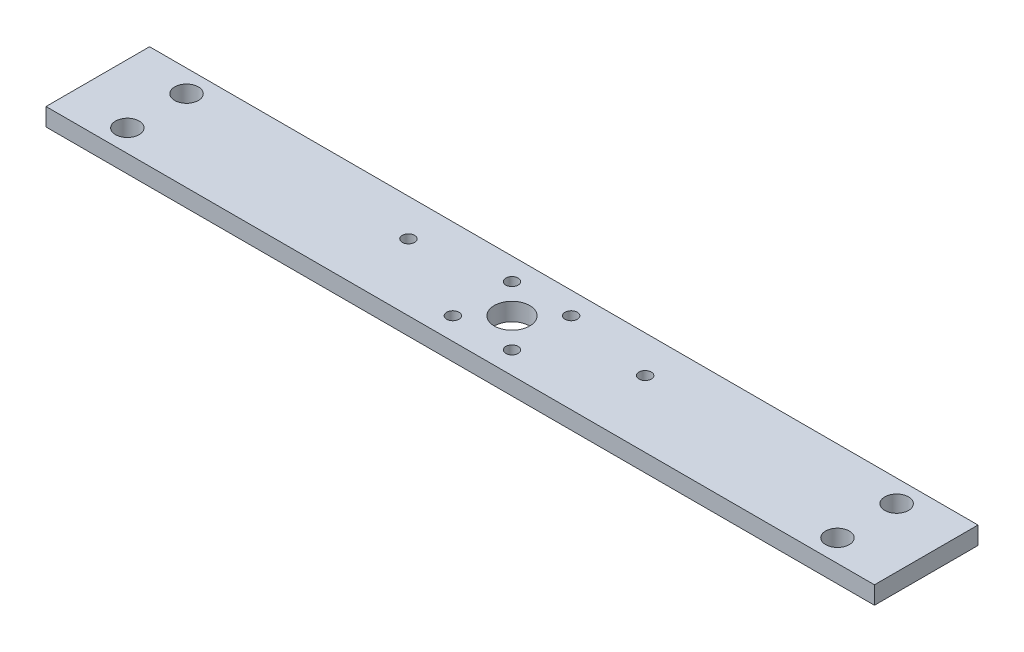
ISO-10303-21;
HEADER;
FILE_DESCRIPTION(('STEP AP214'),'2;1');
FILE_NAME('part.step','',(''),(''),'','','');
FILE_SCHEMA(('AUTOMOTIVE_DESIGN { 1 0 10303 214 1 1 1 1 }'));
ENDSEC;
DATA;
#1=APPLICATION_CONTEXT('core data for automotive mechanical design processes');
#2=APPLICATION_PROTOCOL_DEFINITION('international standard','automotive_design',2000,#1);
#3=PRODUCT_CONTEXT('',#1,'mechanical');
#4=PRODUCT('Part','Part','',(#3));
#5=PRODUCT_RELATED_PRODUCT_CATEGORY('part','',(#4));
#6=PRODUCT_DEFINITION_FORMATION('','',#4);
#7=PRODUCT_DEFINITION_CONTEXT('part definition',#1,'design');
#8=PRODUCT_DEFINITION('design','',#6,#7);
#9=PRODUCT_DEFINITION_SHAPE('','',#8);
#10=(LENGTH_UNIT() NAMED_UNIT(*) SI_UNIT(.MILLI.,.METRE.));
#11=(NAMED_UNIT(*) PLANE_ANGLE_UNIT() SI_UNIT($,.RADIAN.));
#12=(NAMED_UNIT(*) SI_UNIT($,.STERADIAN.) SOLID_ANGLE_UNIT());
#13=UNCERTAINTY_MEASURE_WITH_UNIT(LENGTH_MEASURE(1.E-05),#10,'distance_accuracy_value','');
#14=(GEOMETRIC_REPRESENTATION_CONTEXT(3) GLOBAL_UNCERTAINTY_ASSIGNED_CONTEXT((#13)) GLOBAL_UNIT_ASSIGNED_CONTEXT((#10,
#11,#12)) REPRESENTATION_CONTEXT('',''));
#15=CARTESIAN_POINT('',(0.,0.,0.));
#16=DIRECTION('',(0.,0.,1.));
#17=DIRECTION('',(1.,0.,0.));
#18=AXIS2_PLACEMENT_3D('',#15,#16,#17);
#19=CARTESIAN_POINT('',(0.,6.,0.));
#20=DIRECTION('',(0.,1.,0.));
#21=DIRECTION('',(0.,0.,1.));
#22=AXIS2_PLACEMENT_3D('',#19,#20,#21);
#23=PLANE('',#22);
#24=CARTESIAN_POINT('',(120.,6.,10.));
#25=DIRECTION('',(0.,1.,0.));
#26=DIRECTION('',(0.,0.,-1.));
#27=AXIS2_PLACEMENT_3D('',#24,#25,#26);
#28=CIRCLE('',#27,3.99999999999999);
#29=CARTESIAN_POINT('',(120.,6.,6.00000000000001));
#30=VERTEX_POINT('',#29);
#31=EDGE_CURVE('E198',#30,#30,#28,.T.);
#32=ORIENTED_EDGE('',*,*,#31,.F.);
#33=EDGE_LOOP('',(#32));
#34=FACE_BOUND('',#33,.T.);
#35=CARTESIAN_POINT('',(10.0000000000002,6.,10.));
#36=DIRECTION('',(0.,1.,0.));
#37=DIRECTION('',(0.,0.,1.));
#38=AXIS2_PLACEMENT_3D('',#35,#36,#37);
#39=CIRCLE('',#38,2.08);
#40=CARTESIAN_POINT('',(10.0000000000002,6.,12.08));
#41=VERTEX_POINT('',#40);
#42=EDGE_CURVE('E182',#41,#41,#39,.T.);
#43=ORIENTED_EDGE('',*,*,#42,.F.);
#44=EDGE_LOOP('',(#43));
#45=FACE_BOUND('',#44,.T.);
#46=CARTESIAN_POINT('',(-10.,6.,-9.99999999999986));
#47=DIRECTION('',(0.,1.,0.));
#48=DIRECTION('',(0.,0.,1.));
#49=AXIS2_PLACEMENT_3D('',#46,#47,#48);
#50=CIRCLE('',#49,2.08);
#51=CARTESIAN_POINT('',(-10.,6.,-7.91999999999986));
#52=VERTEX_POINT('',#51);
#53=EDGE_CURVE('E166',#52,#52,#50,.T.);
#54=ORIENTED_EDGE('',*,*,#53,.F.);
#55=EDGE_LOOP('',(#54));
#56=FACE_BOUND('',#55,.T.);
#57=CARTESIAN_POINT('',(-40.,6.,-5.00000000000001));
#58=DIRECTION('',(0.,1.,0.));
#59=DIRECTION('',(0.,0.,-1.));
#60=AXIS2_PLACEMENT_3D('',#57,#58,#59);
#61=CIRCLE('',#60,2.08);
#62=CARTESIAN_POINT('',(-40.,6.,-7.08));
#63=VERTEX_POINT('',#62);
#64=EDGE_CURVE('E150',#63,#63,#61,.T.);
#65=ORIENTED_EDGE('',*,*,#64,.F.);
#66=EDGE_LOOP('',(#65));
#67=FACE_BOUND('',#66,.T.);
#68=CARTESIAN_POINT('',(10.,6.,-10.));
#69=DIRECTION('',(0.,1.,0.));
#70=DIRECTION('',(0.,0.,1.));
#71=AXIS2_PLACEMENT_3D('',#68,#69,#70);
#72=CIRCLE('',#71,2.08);
#73=CARTESIAN_POINT('',(10.,6.,-7.92));
#74=VERTEX_POINT('',#73);
#75=EDGE_CURVE('E134',#74,#74,#72,.T.);
#76=ORIENTED_EDGE('',*,*,#75,.F.);
#77=EDGE_LOOP('',(#76));
#78=FACE_BOUND('',#77,.T.);
#79=DIRECTION('',(0.,0.,-1.));
#80=VECTOR('',#79,1.);
#81=CARTESIAN_POINT('',(140.,6.,-17.5));
#82=LINE('',#81,#80);
#83=CARTESIAN_POINT('',(140.,6.,17.5));
#84=VERTEX_POINT('',#83);
#85=CARTESIAN_POINT('',(140.,6.,-17.5));
#86=VERTEX_POINT('',#85);
#87=EDGE_CURVE('E92',#84,#86,#82,.T.);
#88=ORIENTED_EDGE('',*,*,#87,.T.);
#89=DIRECTION('',(-1.,0.,0.));
#90=VECTOR('',#89,1.);
#91=CARTESIAN_POINT('',(-140.,6.,-17.5));
#92=LINE('',#91,#90);
#93=CARTESIAN_POINT('',(-140.,6.,-17.5));
#94=VERTEX_POINT('',#93);
#95=EDGE_CURVE('E87',#86,#94,#92,.T.);
#96=ORIENTED_EDGE('',*,*,#95,.T.);
#97=DIRECTION('',(0.,0.,1.));
#98=VECTOR('',#97,1.);
#99=CARTESIAN_POINT('',(-140.,6.,-17.5));
#100=LINE('',#99,#98);
#101=CARTESIAN_POINT('',(-140.,6.,17.5));
#102=VERTEX_POINT('',#101);
#103=EDGE_CURVE('E90',#94,#102,#100,.T.);
#104=ORIENTED_EDGE('',*,*,#103,.T.);
#105=DIRECTION('',(1.,0.,0.));
#106=VECTOR('',#105,1.);
#107=CARTESIAN_POINT('',(-140.,6.,17.5));
#108=LINE('',#107,#106);
#109=EDGE_CURVE('E57',#102,#84,#108,.T.);
#110=ORIENTED_EDGE('',*,*,#109,.T.);
#111=EDGE_LOOP('',(#88,#96,#104,#110));
#112=FACE_BOUND('',#111,.T.);
#113=CARTESIAN_POINT('',(40.,6.,-5.00000000000001));
#114=DIRECTION('',(0.,1.,0.));
#115=DIRECTION('',(0.,0.,1.));
#116=AXIS2_PLACEMENT_3D('',#113,#114,#115);
#117=CIRCLE('',#116,2.08);
#118=CARTESIAN_POINT('',(40.,6.,-2.92000000000001));
#119=VERTEX_POINT('',#118);
#120=EDGE_CURVE('E112',#119,#119,#117,.T.);
#121=ORIENTED_EDGE('',*,*,#120,.F.);
#122=EDGE_LOOP('',(#121));
#123=FACE_BOUND('',#122,.T.);
#124=CARTESIAN_POINT('',(120.,6.,-10.));
#125=DIRECTION('',(0.,1.,0.));
#126=DIRECTION('',(0.,0.,1.));
#127=AXIS2_PLACEMENT_3D('',#124,#125,#126);
#128=CIRCLE('',#127,3.99999999999999);
#129=CARTESIAN_POINT('',(120.,6.,-6.00000000000001));
#130=VERTEX_POINT('',#129);
#131=EDGE_CURVE('E142',#130,#130,#128,.T.);
#132=ORIENTED_EDGE('',*,*,#131,.F.);
#133=EDGE_LOOP('',(#132));
#134=FACE_BOUND('',#133,.T.);
#135=CARTESIAN_POINT('',(0.,6.,0.));
#136=DIRECTION('',(0.,1.,0.));
#137=DIRECTION('',(0.,0.,1.));
#138=AXIS2_PLACEMENT_3D('',#135,#136,#137);
#139=CIRCLE('',#138,6.);
#140=CARTESIAN_POINT('',(0.,6.,6.));
#141=VERTEX_POINT('',#140);
#142=EDGE_CURVE('E158',#141,#141,#139,.T.);
#143=ORIENTED_EDGE('',*,*,#142,.F.);
#144=EDGE_LOOP('',(#143));
#145=FACE_BOUND('',#144,.T.);
#146=CARTESIAN_POINT('',(-9.99999999999979,6.,10.0000000000001));
#147=DIRECTION('',(0.,1.,0.));
#148=DIRECTION('',(0.,0.,1.));
#149=AXIS2_PLACEMENT_3D('',#146,#147,#148);
#150=CIRCLE('',#149,2.08);
#151=CARTESIAN_POINT('',(-9.99999999999979,6.,12.0800000000001));
#152=VERTEX_POINT('',#151);
#153=EDGE_CURVE('E174',#152,#152,#150,.T.);
#154=ORIENTED_EDGE('',*,*,#153,.F.);
#155=EDGE_LOOP('',(#154));
#156=FACE_BOUND('',#155,.T.);
#157=CARTESIAN_POINT('',(-120.,6.,-10.));
#158=DIRECTION('',(0.,1.,0.));
#159=DIRECTION('',(0.,0.,-1.));
#160=AXIS2_PLACEMENT_3D('',#157,#158,#159);
#161=CIRCLE('',#160,3.99999999999999);
#162=CARTESIAN_POINT('',(-120.,6.,-14.));
#163=VERTEX_POINT('',#162);
#164=EDGE_CURVE('E190',#163,#163,#161,.T.);
#165=ORIENTED_EDGE('',*,*,#164,.F.);
#166=EDGE_LOOP('',(#165));
#167=FACE_BOUND('',#166,.T.);
#168=CARTESIAN_POINT('',(-120.,6.,10.));
#169=DIRECTION('',(0.,1.,0.));
#170=DIRECTION('',(0.,0.,1.));
#171=AXIS2_PLACEMENT_3D('',#168,#169,#170);
#172=CIRCLE('',#171,3.99999999999999);
#173=CARTESIAN_POINT('',(-120.,6.,14.));
#174=VERTEX_POINT('',#173);
#175=EDGE_CURVE('E206',#174,#174,#172,.T.);
#176=ORIENTED_EDGE('',*,*,#175,.F.);
#177=EDGE_LOOP('',(#176));
#178=FACE_BOUND('',#177,.T.);
#179=ADVANCED_FACE('F39',(#34,#45,#56,#67,#78,#112,#123,#134,#145,#156,#167,#178),#23,.T.);
#180=CARTESIAN_POINT('',(0.,0.,0.));
#181=DIRECTION('',(0.,1.,0.));
#182=DIRECTION('',(0.,0.,1.));
#183=AXIS2_PLACEMENT_3D('',#180,#181,#182);
#184=PLANE('',#183);
#185=DIRECTION('',(0.,0.,-1.));
#186=VECTOR('',#185,1.);
#187=CARTESIAN_POINT('',(140.,0.,-17.5));
#188=LINE('',#187,#186);
#189=CARTESIAN_POINT('',(140.,0.,17.5));
#190=VERTEX_POINT('',#189);
#191=CARTESIAN_POINT('',(140.,0.,-17.5));
#192=VERTEX_POINT('',#191);
#193=EDGE_CURVE('E108',#190,#192,#188,.T.);
#194=ORIENTED_EDGE('',*,*,#193,.F.);
#195=DIRECTION('',(1.,0.,0.));
#196=VECTOR('',#195,1.);
#197=CARTESIAN_POINT('',(-140.,0.,17.5));
#198=LINE('',#197,#196);
#199=CARTESIAN_POINT('',(-140.,0.,17.5));
#200=VERTEX_POINT('',#199);
#201=EDGE_CURVE('E80',#200,#190,#198,.T.);
#202=ORIENTED_EDGE('',*,*,#201,.F.);
#203=DIRECTION('',(0.,0.,1.));
#204=VECTOR('',#203,1.);
#205=CARTESIAN_POINT('',(-140.,0.,-17.5));
#206=LINE('',#205,#204);
#207=CARTESIAN_POINT('',(-140.,0.,-17.5));
#208=VERTEX_POINT('',#207);
#209=EDGE_CURVE('E74',#208,#200,#206,.T.);
#210=ORIENTED_EDGE('',*,*,#209,.F.);
#211=DIRECTION('',(-1.,0.,0.));
#212=VECTOR('',#211,1.);
#213=CARTESIAN_POINT('',(-140.,0.,-17.5));
#214=LINE('',#213,#212);
#215=EDGE_CURVE('E97',#192,#208,#214,.T.);
#216=ORIENTED_EDGE('',*,*,#215,.F.);
#217=EDGE_LOOP('',(#194,#202,#210,#216));
#218=FACE_BOUND('',#217,.T.);
#219=CARTESIAN_POINT('',(40.,0.,-5.00000000000001));
#220=DIRECTION('',(0.,1.,0.));
#221=DIRECTION('',(0.,0.,1.));
#222=AXIS2_PLACEMENT_3D('',#219,#220,#221);
#223=CIRCLE('',#222,2.08);
#224=CARTESIAN_POINT('',(40.,0.,-2.92000000000001));
#225=VERTEX_POINT('',#224);
#226=EDGE_CURVE('E130',#225,#225,#223,.T.);
#227=ORIENTED_EDGE('',*,*,#226,.T.);
#228=EDGE_LOOP('',(#227));
#229=FACE_BOUND('',#228,.T.);
#230=CARTESIAN_POINT('',(10.,0.,-10.));
#231=DIRECTION('',(0.,1.,0.));
#232=DIRECTION('',(0.,0.,1.));
#233=AXIS2_PLACEMENT_3D('',#230,#231,#232);
#234=CIRCLE('',#233,2.08);
#235=CARTESIAN_POINT('',(10.,0.,-7.92));
#236=VERTEX_POINT('',#235);
#237=EDGE_CURVE('E138',#236,#236,#234,.T.);
#238=ORIENTED_EDGE('',*,*,#237,.T.);
#239=EDGE_LOOP('',(#238));
#240=FACE_BOUND('',#239,.T.);
#241=CARTESIAN_POINT('',(120.,0.,-10.));
#242=DIRECTION('',(0.,1.,0.));
#243=DIRECTION('',(0.,0.,1.));
#244=AXIS2_PLACEMENT_3D('',#241,#242,#243);
#245=CIRCLE('',#244,3.99999999999999);
#246=CARTESIAN_POINT('',(120.,0.,-6.00000000000001));
#247=VERTEX_POINT('',#246);
#248=EDGE_CURVE('E146',#247,#247,#245,.T.);
#249=ORIENTED_EDGE('',*,*,#248,.T.);
#250=EDGE_LOOP('',(#249));
#251=FACE_BOUND('',#250,.T.);
#252=CARTESIAN_POINT('',(-40.,0.,-5.00000000000001));
#253=DIRECTION('',(0.,1.,0.));
#254=DIRECTION('',(0.,0.,-1.));
#255=AXIS2_PLACEMENT_3D('',#252,#253,#254);
#256=CIRCLE('',#255,2.08);
#257=CARTESIAN_POINT('',(-40.,0.,-7.08));
#258=VERTEX_POINT('',#257);
#259=EDGE_CURVE('E154',#258,#258,#256,.T.);
#260=ORIENTED_EDGE('',*,*,#259,.T.);
#261=EDGE_LOOP('',(#260));
#262=FACE_BOUND('',#261,.T.);
#263=CARTESIAN_POINT('',(0.,0.,0.));
#264=DIRECTION('',(0.,1.,0.));
#265=DIRECTION('',(0.,0.,1.));
#266=AXIS2_PLACEMENT_3D('',#263,#264,#265);
#267=CIRCLE('',#266,6.);
#268=CARTESIAN_POINT('',(0.,0.,6.));
#269=VERTEX_POINT('',#268);
#270=EDGE_CURVE('E162',#269,#269,#267,.T.);
#271=ORIENTED_EDGE('',*,*,#270,.T.);
#272=EDGE_LOOP('',(#271));
#273=FACE_BOUND('',#272,.T.);
#274=CARTESIAN_POINT('',(-10.,0.,-9.99999999999986));
#275=DIRECTION('',(0.,1.,0.));
#276=DIRECTION('',(0.,0.,1.));
#277=AXIS2_PLACEMENT_3D('',#274,#275,#276);
#278=CIRCLE('',#277,2.08);
#279=CARTESIAN_POINT('',(-10.,0.,-7.91999999999986));
#280=VERTEX_POINT('',#279);
#281=EDGE_CURVE('E170',#280,#280,#278,.T.);
#282=ORIENTED_EDGE('',*,*,#281,.T.);
#283=EDGE_LOOP('',(#282));
#284=FACE_BOUND('',#283,.T.);
#285=CARTESIAN_POINT('',(-9.99999999999979,0.,10.0000000000001));
#286=DIRECTION('',(0.,1.,0.));
#287=DIRECTION('',(0.,0.,1.));
#288=AXIS2_PLACEMENT_3D('',#285,#286,#287);
#289=CIRCLE('',#288,2.08);
#290=CARTESIAN_POINT('',(-9.99999999999979,0.,12.0800000000001));
#291=VERTEX_POINT('',#290);
#292=EDGE_CURVE('E178',#291,#291,#289,.T.);
#293=ORIENTED_EDGE('',*,*,#292,.T.);
#294=EDGE_LOOP('',(#293));
#295=FACE_BOUND('',#294,.T.);
#296=CARTESIAN_POINT('',(10.0000000000002,0.,10.));
#297=DIRECTION('',(0.,1.,0.));
#298=DIRECTION('',(0.,0.,1.));
#299=AXIS2_PLACEMENT_3D('',#296,#297,#298);
#300=CIRCLE('',#299,2.08);
#301=CARTESIAN_POINT('',(10.0000000000002,0.,12.08));
#302=VERTEX_POINT('',#301);
#303=EDGE_CURVE('E186',#302,#302,#300,.T.);
#304=ORIENTED_EDGE('',*,*,#303,.T.);
#305=EDGE_LOOP('',(#304));
#306=FACE_BOUND('',#305,.T.);
#307=CARTESIAN_POINT('',(-120.,0.,-10.));
#308=DIRECTION('',(0.,1.,0.));
#309=DIRECTION('',(0.,0.,-1.));
#310=AXIS2_PLACEMENT_3D('',#307,#308,#309);
#311=CIRCLE('',#310,3.99999999999999);
#312=CARTESIAN_POINT('',(-120.,0.,-14.));
#313=VERTEX_POINT('',#312);
#314=EDGE_CURVE('E194',#313,#313,#311,.T.);
#315=ORIENTED_EDGE('',*,*,#314,.T.);
#316=EDGE_LOOP('',(#315));
#317=FACE_BOUND('',#316,.T.);
#318=CARTESIAN_POINT('',(120.,0.,10.));
#319=DIRECTION('',(0.,1.,0.));
#320=DIRECTION('',(0.,0.,-1.));
#321=AXIS2_PLACEMENT_3D('',#318,#319,#320);
#322=CIRCLE('',#321,3.99999999999999);
#323=CARTESIAN_POINT('',(120.,0.,6.00000000000001));
#324=VERTEX_POINT('',#323);
#325=EDGE_CURVE('E202',#324,#324,#322,.T.);
#326=ORIENTED_EDGE('',*,*,#325,.T.);
#327=EDGE_LOOP('',(#326));
#328=FACE_BOUND('',#327,.T.);
#329=CARTESIAN_POINT('',(-120.,0.,10.));
#330=DIRECTION('',(0.,1.,0.));
#331=DIRECTION('',(0.,0.,1.));
#332=AXIS2_PLACEMENT_3D('',#329,#330,#331);
#333=CIRCLE('',#332,3.99999999999999);
#334=CARTESIAN_POINT('',(-120.,0.,14.));
#335=VERTEX_POINT('',#334);
#336=EDGE_CURVE('E210',#335,#335,#333,.T.);
#337=ORIENTED_EDGE('',*,*,#336,.T.);
#338=EDGE_LOOP('',(#337));
#339=FACE_BOUND('',#338,.T.);
#340=ADVANCED_FACE('F125',(#218,#229,#240,#251,#262,#273,#284,#295,#306,#317,#328,#339),#184,.F.);
#341=CARTESIAN_POINT('',(140.,6.,-17.5));
#342=DIRECTION('',(-1.,0.,0.));
#343=DIRECTION('',(0.,0.,1.));
#344=AXIS2_PLACEMENT_3D('',#341,#342,#343);
#345=PLANE('',#344);
#346=ORIENTED_EDGE('',*,*,#193,.T.);
#347=DIRECTION('',(0.,-1.,0.));
#348=VECTOR('',#347,1.);
#349=CARTESIAN_POINT('',(140.,6.,-17.5));
#350=LINE('',#349,#348);
#351=EDGE_CURVE('E11',#86,#192,#350,.T.);
#352=ORIENTED_EDGE('',*,*,#351,.F.);
#353=ORIENTED_EDGE('',*,*,#87,.F.);
#354=DIRECTION('',(0.,-1.,0.));
#355=VECTOR('',#354,1.);
#356=CARTESIAN_POINT('',(140.,6.,17.5));
#357=LINE('',#356,#355);
#358=EDGE_CURVE('E104',#84,#190,#357,.T.);
#359=ORIENTED_EDGE('',*,*,#358,.T.);
#360=EDGE_LOOP('',(#346,#352,#353,#359));
#361=FACE_BOUND('',#360,.T.);
#362=ADVANCED_FACE('F41',(#361),#345,.F.);
#363=CARTESIAN_POINT('',(-140.,6.,-17.5));
#364=DIRECTION('',(0.,0.,1.));
#365=DIRECTION('',(1.,0.,0.));
#366=AXIS2_PLACEMENT_3D('',#363,#364,#365);
#367=PLANE('',#366);
#368=ORIENTED_EDGE('',*,*,#215,.T.);
#369=DIRECTION('',(0.,-1.,0.));
#370=VECTOR('',#369,1.);
#371=CARTESIAN_POINT('',(-140.,6.,-17.5));
#372=LINE('',#371,#370);
#373=EDGE_CURVE('E49',#94,#208,#372,.T.);
#374=ORIENTED_EDGE('',*,*,#373,.F.);
#375=ORIENTED_EDGE('',*,*,#95,.F.);
#376=ORIENTED_EDGE('',*,*,#351,.T.);
#377=EDGE_LOOP('',(#368,#374,#375,#376));
#378=FACE_BOUND('',#377,.T.);
#379=ADVANCED_FACE('F96',(#378),#367,.F.);
#380=CARTESIAN_POINT('',(-140.,6.,-17.5));
#381=DIRECTION('',(1.,0.,0.));
#382=DIRECTION('',(0.,0.,-1.));
#383=AXIS2_PLACEMENT_3D('',#380,#381,#382);
#384=PLANE('',#383);
#385=ORIENTED_EDGE('',*,*,#209,.T.);
#386=DIRECTION('',(0.,-1.,0.));
#387=VECTOR('',#386,1.);
#388=CARTESIAN_POINT('',(-140.,6.,17.5));
#389=LINE('',#388,#387);
#390=EDGE_CURVE('E99',#102,#200,#389,.T.);
#391=ORIENTED_EDGE('',*,*,#390,.F.);
#392=ORIENTED_EDGE('',*,*,#103,.F.);
#393=ORIENTED_EDGE('',*,*,#373,.T.);
#394=EDGE_LOOP('',(#385,#391,#392,#393));
#395=FACE_BOUND('',#394,.T.);
#396=ADVANCED_FACE('F100',(#395),#384,.F.);
#397=CARTESIAN_POINT('',(-140.,6.,17.5));
#398=DIRECTION('',(0.,0.,-1.));
#399=DIRECTION('',(-1.,0.,0.));
#400=AXIS2_PLACEMENT_3D('',#397,#398,#399);
#401=PLANE('',#400);
#402=ORIENTED_EDGE('',*,*,#201,.T.);
#403=ORIENTED_EDGE('',*,*,#358,.F.);
#404=ORIENTED_EDGE('',*,*,#109,.F.);
#405=ORIENTED_EDGE('',*,*,#390,.T.);
#406=EDGE_LOOP('',(#402,#403,#404,#405));
#407=FACE_BOUND('',#406,.T.);
#408=ADVANCED_FACE('F122',(#407),#401,.F.);
#409=CARTESIAN_POINT('',(40.,6.,-5.00000000000001));
#410=DIRECTION('',(0.,-1.,0.));
#411=DIRECTION('',(0.,0.,-1.));
#412=AXIS2_PLACEMENT_3D('',#409,#410,#411);
#413=CYLINDRICAL_SURFACE('',#412,2.08);
#414=ORIENTED_EDGE('',*,*,#120,.T.);
#415=EDGE_LOOP('',(#414));
#416=FACE_BOUND('',#415,.T.);
#417=ORIENTED_EDGE('',*,*,#226,.F.);
#418=EDGE_LOOP('',(#417));
#419=FACE_BOUND('',#418,.T.);
#420=ADVANCED_FACE('F231',(#416,#419),#413,.F.);
#421=CARTESIAN_POINT('',(10.,6.,-10.));
#422=DIRECTION('',(0.,-1.,0.));
#423=DIRECTION('',(0.,0.,-1.));
#424=AXIS2_PLACEMENT_3D('',#421,#422,#423);
#425=CYLINDRICAL_SURFACE('',#424,2.08);
#426=ORIENTED_EDGE('',*,*,#75,.T.);
#427=EDGE_LOOP('',(#426));
#428=FACE_BOUND('',#427,.T.);
#429=ORIENTED_EDGE('',*,*,#237,.F.);
#430=EDGE_LOOP('',(#429));
#431=FACE_BOUND('',#430,.T.);
#432=ADVANCED_FACE('F277',(#428,#431),#425,.F.);
#433=CARTESIAN_POINT('',(120.,6.,-10.));
#434=DIRECTION('',(0.,-1.,0.));
#435=DIRECTION('',(0.,0.,-1.));
#436=AXIS2_PLACEMENT_3D('',#433,#434,#435);
#437=CYLINDRICAL_SURFACE('',#436,3.99999999999999);
#438=ORIENTED_EDGE('',*,*,#131,.T.);
#439=EDGE_LOOP('',(#438));
#440=FACE_BOUND('',#439,.T.);
#441=ORIENTED_EDGE('',*,*,#248,.F.);
#442=EDGE_LOOP('',(#441));
#443=FACE_BOUND('',#442,.T.);
#444=ADVANCED_FACE('F285',(#440,#443),#437,.F.);
#445=CARTESIAN_POINT('',(-40.,6.,-5.00000000000001));
#446=DIRECTION('',(0.,-1.,0.));
#447=DIRECTION('',(0.,0.,-1.));
#448=AXIS2_PLACEMENT_3D('',#445,#446,#447);
#449=CYLINDRICAL_SURFACE('',#448,2.08);
#450=ORIENTED_EDGE('',*,*,#64,.T.);
#451=EDGE_LOOP('',(#450));
#452=FACE_BOUND('',#451,.T.);
#453=ORIENTED_EDGE('',*,*,#259,.F.);
#454=EDGE_LOOP('',(#453));
#455=FACE_BOUND('',#454,.T.);
#456=ADVANCED_FACE('F293',(#452,#455),#449,.F.);
#457=CARTESIAN_POINT('',(0.,6.,0.));
#458=DIRECTION('',(0.,-1.,0.));
#459=DIRECTION('',(0.,0.,-1.));
#460=AXIS2_PLACEMENT_3D('',#457,#458,#459);
#461=CYLINDRICAL_SURFACE('',#460,6.);
#462=ORIENTED_EDGE('',*,*,#142,.T.);
#463=EDGE_LOOP('',(#462));
#464=FACE_BOUND('',#463,.T.);
#465=ORIENTED_EDGE('',*,*,#270,.F.);
#466=EDGE_LOOP('',(#465));
#467=FACE_BOUND('',#466,.T.);
#468=ADVANCED_FACE('F302',(#464,#467),#461,.F.);
#469=CARTESIAN_POINT('',(-10.,6.,-9.99999999999986));
#470=DIRECTION('',(0.,-1.,0.));
#471=DIRECTION('',(0.,0.,-1.));
#472=AXIS2_PLACEMENT_3D('',#469,#470,#471);
#473=CYLINDRICAL_SURFACE('',#472,2.08);
#474=ORIENTED_EDGE('',*,*,#53,.T.);
#475=EDGE_LOOP('',(#474));
#476=FACE_BOUND('',#475,.T.);
#477=ORIENTED_EDGE('',*,*,#281,.F.);
#478=EDGE_LOOP('',(#477));
#479=FACE_BOUND('',#478,.T.);
#480=ADVANCED_FACE('F311',(#476,#479),#473,.F.);
#481=CARTESIAN_POINT('',(-9.99999999999979,6.,10.0000000000001));
#482=DIRECTION('',(0.,-1.,0.));
#483=DIRECTION('',(0.,0.,-1.));
#484=AXIS2_PLACEMENT_3D('',#481,#482,#483);
#485=CYLINDRICAL_SURFACE('',#484,2.08);
#486=ORIENTED_EDGE('',*,*,#153,.T.);
#487=EDGE_LOOP('',(#486));
#488=FACE_BOUND('',#487,.T.);
#489=ORIENTED_EDGE('',*,*,#292,.F.);
#490=EDGE_LOOP('',(#489));
#491=FACE_BOUND('',#490,.T.);
#492=ADVANCED_FACE('F320',(#488,#491),#485,.F.);
#493=CARTESIAN_POINT('',(10.0000000000002,6.,10.));
#494=DIRECTION('',(0.,-1.,0.));
#495=DIRECTION('',(0.,0.,-1.));
#496=AXIS2_PLACEMENT_3D('',#493,#494,#495);
#497=CYLINDRICAL_SURFACE('',#496,2.08);
#498=ORIENTED_EDGE('',*,*,#42,.T.);
#499=EDGE_LOOP('',(#498));
#500=FACE_BOUND('',#499,.T.);
#501=ORIENTED_EDGE('',*,*,#303,.F.);
#502=EDGE_LOOP('',(#501));
#503=FACE_BOUND('',#502,.T.);
#504=ADVANCED_FACE('F329',(#500,#503),#497,.F.);
#505=CARTESIAN_POINT('',(-120.,6.,-10.));
#506=DIRECTION('',(0.,-1.,0.));
#507=DIRECTION('',(0.,0.,-1.));
#508=AXIS2_PLACEMENT_3D('',#505,#506,#507);
#509=CYLINDRICAL_SURFACE('',#508,3.99999999999999);
#510=ORIENTED_EDGE('',*,*,#164,.T.);
#511=EDGE_LOOP('',(#510));
#512=FACE_BOUND('',#511,.T.);
#513=ORIENTED_EDGE('',*,*,#314,.F.);
#514=EDGE_LOOP('',(#513));
#515=FACE_BOUND('',#514,.T.);
#516=ADVANCED_FACE('F338',(#512,#515),#509,.F.);
#517=CARTESIAN_POINT('',(120.,6.,10.));
#518=DIRECTION('',(0.,-1.,0.));
#519=DIRECTION('',(0.,0.,-1.));
#520=AXIS2_PLACEMENT_3D('',#517,#518,#519);
#521=CYLINDRICAL_SURFACE('',#520,3.99999999999999);
#522=ORIENTED_EDGE('',*,*,#31,.T.);
#523=EDGE_LOOP('',(#522));
#524=FACE_BOUND('',#523,.T.);
#525=ORIENTED_EDGE('',*,*,#325,.F.);
#526=EDGE_LOOP('',(#525));
#527=FACE_BOUND('',#526,.T.);
#528=ADVANCED_FACE('F347',(#524,#527),#521,.F.);
#529=CARTESIAN_POINT('',(-120.,6.,10.));
#530=DIRECTION('',(0.,-1.,0.));
#531=DIRECTION('',(0.,0.,-1.));
#532=AXIS2_PLACEMENT_3D('',#529,#530,#531);
#533=CYLINDRICAL_SURFACE('',#532,3.99999999999999);
#534=ORIENTED_EDGE('',*,*,#175,.T.);
#535=EDGE_LOOP('',(#534));
#536=FACE_BOUND('',#535,.T.);
#537=ORIENTED_EDGE('',*,*,#336,.F.);
#538=EDGE_LOOP('',(#537));
#539=FACE_BOUND('',#538,.T.);
#540=ADVANCED_FACE('F218',(#536,#539),#533,.F.);
#541=CLOSED_SHELL('',(#179,#340,#362,#379,#396,#408,#420,#432,#444,#456,#468,#480,#492,#504,
#516,#528,#540));
#542=MANIFOLD_SOLID_BREP('B2',#541);
#543=ADVANCED_BREP_SHAPE_REPRESENTATION('',(#18,#542),#14);
#544=SHAPE_DEFINITION_REPRESENTATION(#9,#543);
ENDSEC;
END-ISO-10303-21;
